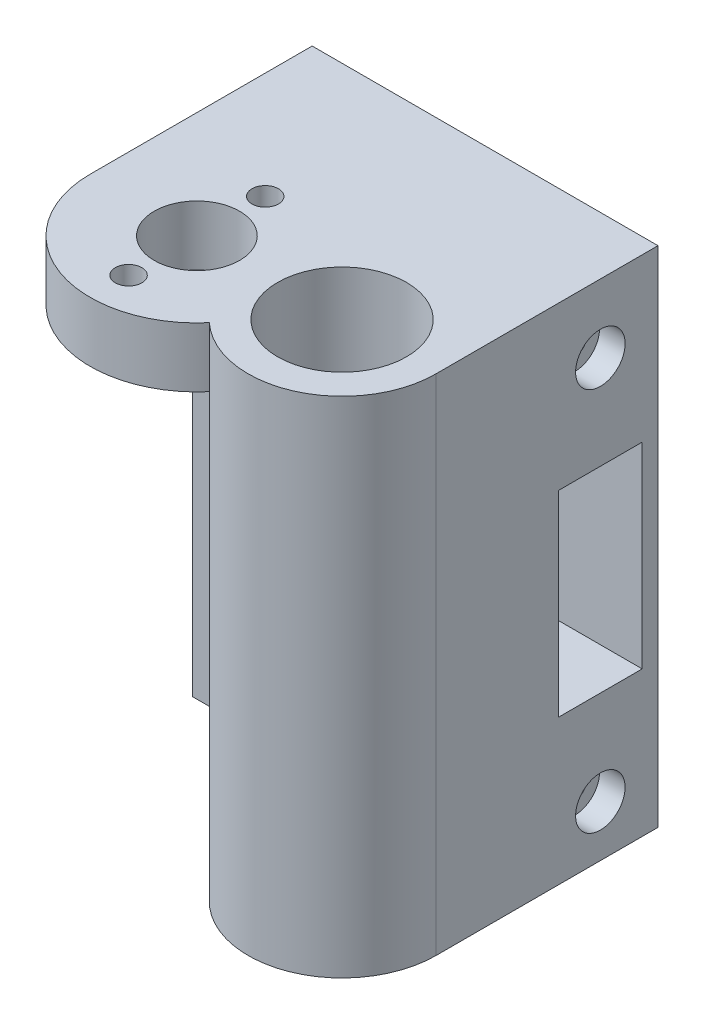
ISO-10303-21;
HEADER;
FILE_DESCRIPTION(('STEP AP214'),'2;1');
FILE_NAME('part.step','',(''),(''),'','','');
FILE_SCHEMA(('AUTOMOTIVE_DESIGN { 1 0 10303 214 1 1 1 1 }'));
ENDSEC;
DATA;
#1=APPLICATION_CONTEXT('core data for automotive mechanical design processes');
#2=APPLICATION_PROTOCOL_DEFINITION('international standard','automotive_design',2000,#1);
#3=PRODUCT_CONTEXT('',#1,'mechanical');
#4=PRODUCT('Part','Part','',(#3));
#5=PRODUCT_RELATED_PRODUCT_CATEGORY('part','',(#4));
#6=PRODUCT_DEFINITION_FORMATION('','',#4);
#7=PRODUCT_DEFINITION_CONTEXT('part definition',#1,'design');
#8=PRODUCT_DEFINITION('design','',#6,#7);
#9=PRODUCT_DEFINITION_SHAPE('','',#8);
#10=(LENGTH_UNIT() NAMED_UNIT(*) SI_UNIT(.MILLI.,.METRE.));
#11=(NAMED_UNIT(*) PLANE_ANGLE_UNIT() SI_UNIT($,.RADIAN.));
#12=(NAMED_UNIT(*) SI_UNIT($,.STERADIAN.) SOLID_ANGLE_UNIT());
#13=UNCERTAINTY_MEASURE_WITH_UNIT(LENGTH_MEASURE(1.E-05),#10,'distance_accuracy_value','');
#14=(GEOMETRIC_REPRESENTATION_CONTEXT(3) GLOBAL_UNCERTAINTY_ASSIGNED_CONTEXT((#13)) GLOBAL_UNIT_ASSIGNED_CONTEXT((#10,
#11,#12)) REPRESENTATION_CONTEXT('',''));
#15=CARTESIAN_POINT('',(0.,0.,0.));
#16=DIRECTION('',(0.,0.,1.));
#17=DIRECTION('',(1.,0.,0.));
#18=AXIS2_PLACEMENT_3D('',#15,#16,#17);
#19=CARTESIAN_POINT('',(-12.5,-46.,-19.25));
#20=DIRECTION('',(1.,0.,0.));
#21=DIRECTION('',(0.,0.,-1.));
#22=AXIS2_PLACEMENT_3D('',#19,#20,#21);
#23=CYLINDRICAL_SURFACE('',#22,1.4);
#24=CARTESIAN_POINT('',(22.5,-46.,-19.25));
#25=DIRECTION('',(-1.,0.,0.));
#26=DIRECTION('',(0.,0.,1.));
#27=AXIS2_PLACEMENT_3D('',#24,#25,#26);
#28=CIRCLE('',#27,1.4);
#29=CARTESIAN_POINT('',(22.5,-46.,-17.85));
#30=VERTEX_POINT('',#29);
#31=EDGE_CURVE('E251',#30,#30,#28,.T.);
#32=ORIENTED_EDGE('',*,*,#31,.T.);
#33=EDGE_LOOP('',(#32));
#34=FACE_BOUND('',#33,.T.);
#35=CARTESIAN_POINT('',(25.,-46.,-19.25));
#36=DIRECTION('',(1.,0.,0.));
#37=DIRECTION('',(0.,0.,-1.));
#38=AXIS2_PLACEMENT_3D('',#35,#36,#37);
#39=CIRCLE('',#38,1.4);
#40=CARTESIAN_POINT('',(25.,-46.,-20.65));
#41=VERTEX_POINT('',#40);
#42=EDGE_CURVE('E268',#41,#41,#39,.T.);
#43=ORIENTED_EDGE('',*,*,#42,.T.);
#44=EDGE_LOOP('',(#43));
#45=FACE_BOUND('',#44,.T.);
#46=ADVANCED_FACE('F37',(#34,#45),#23,.F.);
#47=CARTESIAN_POINT('',(-12.5,-1.,-19.25));
#48=DIRECTION('',(1.,0.,0.));
#49=DIRECTION('',(0.,0.,-1.));
#50=AXIS2_PLACEMENT_3D('',#47,#48,#49);
#51=CYLINDRICAL_SURFACE('',#50,1.4);
#52=CARTESIAN_POINT('',(22.5,-1.,-19.25));
#53=DIRECTION('',(-1.,0.,0.));
#54=DIRECTION('',(0.,0.,1.));
#55=AXIS2_PLACEMENT_3D('',#52,#53,#54);
#56=CIRCLE('',#55,1.4);
#57=CARTESIAN_POINT('',(22.5,-1.,-17.85));
#58=VERTEX_POINT('',#57);
#59=EDGE_CURVE('E159',#58,#58,#56,.T.);
#60=ORIENTED_EDGE('',*,*,#59,.T.);
#61=EDGE_LOOP('',(#60));
#62=FACE_BOUND('',#61,.T.);
#63=CARTESIAN_POINT('',(25.,-1.,-19.25));
#64=DIRECTION('',(1.,0.,0.));
#65=DIRECTION('',(0.,0.,-1.));
#66=AXIS2_PLACEMENT_3D('',#63,#64,#65);
#67=CIRCLE('',#66,1.4);
#68=CARTESIAN_POINT('',(25.,-1.,-20.65));
#69=VERTEX_POINT('',#68);
#70=EDGE_CURVE('E260',#69,#69,#67,.T.);
#71=ORIENTED_EDGE('',*,*,#70,.T.);
#72=EDGE_LOOP('',(#71));
#73=FACE_BOUND('',#72,.T.);
#74=ADVANCED_FACE('F364',(#62,#73),#51,.F.);
#75=CARTESIAN_POINT('',(17.,0.,0.));
#76=DIRECTION('',(0.,1.,0.));
#77=DIRECTION('',(0.,0.,1.));
#78=AXIS2_PLACEMENT_3D('',#75,#76,#77);
#79=PLANE('',#78);
#80=CARTESIAN_POINT('',(0.,0.,8.));
#81=DIRECTION('',(0.,1.,0.));
#82=DIRECTION('',(0.,0.,1.));
#83=AXIS2_PLACEMENT_3D('',#80,#81,#82);
#84=CIRCLE('',#83,1.55);
#85=CARTESIAN_POINT('',(0.,0.,9.55));
#86=VERTEX_POINT('',#85);
#87=EDGE_CURVE('E288',#86,#86,#84,.T.);
#88=ORIENTED_EDGE('',*,*,#87,.T.);
#89=EDGE_LOOP('',(#88));
#90=FACE_BOUND('',#89,.T.);
#91=CARTESIAN_POINT('',(0.,0.,-8.));
#92=DIRECTION('',(0.,1.,0.));
#93=DIRECTION('',(0.,0.,1.));
#94=AXIS2_PLACEMENT_3D('',#91,#92,#93);
#95=CIRCLE('',#94,1.55);
#96=CARTESIAN_POINT('',(0.,0.,-6.45));
#97=VERTEX_POINT('',#96);
#98=EDGE_CURVE('E280',#97,#97,#95,.T.);
#99=ORIENTED_EDGE('',*,*,#98,.T.);
#100=EDGE_LOOP('',(#99));
#101=FACE_BOUND('',#100,.T.);
#102=CARTESIAN_POINT('',(0.,0.,0.));
#103=DIRECTION('',(0.,1.,0.));
#104=DIRECTION('',(0.,0.,1.));
#105=AXIS2_PLACEMENT_3D('',#102,#103,#104);
#106=CIRCLE('',#105,5.);
#107=CARTESIAN_POINT('',(0.,0.,5.));
#108=VERTEX_POINT('',#107);
#109=EDGE_CURVE('E217',#108,#108,#106,.T.);
#110=ORIENTED_EDGE('',*,*,#109,.T.);
#111=EDGE_LOOP('',(#110));
#112=FACE_BOUND('',#111,.T.);
#113=CARTESIAN_POINT('',(17.,0.,0.));
#114=DIRECTION('',(0.,-1.,0.));
#115=DIRECTION('',(0.,0.,-1.));
#116=AXIS2_PLACEMENT_3D('',#113,#114,#115);
#117=CIRCLE('',#116,11.);
#118=CARTESIAN_POINT('',(9.53676470588235,0.,8.08084890000034));
#119=VERTEX_POINT('',#118);
#120=CARTESIAN_POINT('',(5.99999999999999,0.,0.));
#121=VERTEX_POINT('',#120);
#122=EDGE_CURVE('E11',#119,#121,#117,.T.);
#123=ORIENTED_EDGE('',*,*,#122,.F.);
#124=CARTESIAN_POINT('',(0.,0.,0.));
#125=DIRECTION('',(0.,1.,0.));
#126=DIRECTION('',(0.,0.,1.));
#127=AXIS2_PLACEMENT_3D('',#124,#125,#126);
#128=CIRCLE('',#127,12.5);
#129=CARTESIAN_POINT('',(-12.5,0.,0.));
#130=VERTEX_POINT('',#129);
#131=EDGE_CURVE('E228',#130,#119,#128,.T.);
#132=ORIENTED_EDGE('',*,*,#131,.F.);
#133=DIRECTION('',(0.,0.,1.));
#134=VECTOR('',#133,1.);
#135=CARTESIAN_POINT('',(-12.5,0.,0.));
#136=LINE('',#135,#134);
#137=CARTESIAN_POINT('',(-12.5,0.,-12.));
#138=VERTEX_POINT('',#137);
#139=EDGE_CURVE('E221',#138,#130,#136,.T.);
#140=ORIENTED_EDGE('',*,*,#139,.F.);
#141=DIRECTION('',(1.,0.,0.));
#142=VECTOR('',#141,1.);
#143=CARTESIAN_POINT('',(0.,0.,-12.));
#144=LINE('',#143,#142);
#145=CARTESIAN_POINT('',(6.,0.,-12.));
#146=VERTEX_POINT('',#145);
#147=EDGE_CURVE('E185',#138,#146,#144,.T.);
#148=ORIENTED_EDGE('',*,*,#147,.T.);
#149=DIRECTION('',(0.,0.,-1.));
#150=VECTOR('',#149,1.);
#151=CARTESIAN_POINT('',(5.99999999999999,0.,0.));
#152=LINE('',#151,#150);
#153=EDGE_CURVE('E178',#121,#146,#152,.T.);
#154=ORIENTED_EDGE('',*,*,#153,.F.);
#155=EDGE_LOOP('',(#123,#132,#140,#148,#154));
#156=FACE_BOUND('',#155,.T.);
#157=ADVANCED_FACE('F301',(#90,#101,#112,#156),#79,.F.);
#158=CARTESIAN_POINT('',(17.,7.,0.));
#159=DIRECTION('',(0.,1.,0.));
#160=DIRECTION('',(0.,0.,1.));
#161=AXIS2_PLACEMENT_3D('',#158,#159,#160);
#162=PLANE('',#161);
#163=CARTESIAN_POINT('',(0.,7.,8.));
#164=DIRECTION('',(0.,1.,0.));
#165=DIRECTION('',(0.,0.,1.));
#166=AXIS2_PLACEMENT_3D('',#163,#164,#165);
#167=CIRCLE('',#166,1.55);
#168=CARTESIAN_POINT('',(0.,7.,9.55));
#169=VERTEX_POINT('',#168);
#170=EDGE_CURVE('E291',#169,#169,#167,.T.);
#171=ORIENTED_EDGE('',*,*,#170,.F.);
#172=EDGE_LOOP('',(#171));
#173=FACE_BOUND('',#172,.T.);
#174=CARTESIAN_POINT('',(0.,7.,-8.));
#175=DIRECTION('',(0.,1.,0.));
#176=DIRECTION('',(0.,0.,1.));
#177=AXIS2_PLACEMENT_3D('',#174,#175,#176);
#178=CIRCLE('',#177,1.55);
#179=CARTESIAN_POINT('',(0.,7.,-6.45));
#180=VERTEX_POINT('',#179);
#181=EDGE_CURVE('E285',#180,#180,#178,.T.);
#182=ORIENTED_EDGE('',*,*,#181,.F.);
#183=EDGE_LOOP('',(#182));
#184=FACE_BOUND('',#183,.T.);
#185=CARTESIAN_POINT('',(0.,7.,0.));
#186=DIRECTION('',(0.,1.,0.));
#187=DIRECTION('',(0.,0.,1.));
#188=AXIS2_PLACEMENT_3D('',#185,#186,#187);
#189=CIRCLE('',#188,5.);
#190=CARTESIAN_POINT('',(0.,7.,5.));
#191=VERTEX_POINT('',#190);
#192=EDGE_CURVE('E218',#191,#191,#189,.T.);
#193=ORIENTED_EDGE('',*,*,#192,.F.);
#194=EDGE_LOOP('',(#193));
#195=FACE_BOUND('',#194,.T.);
#196=CARTESIAN_POINT('',(17.,7.,0.));
#197=DIRECTION('',(0.,1.,0.));
#198=DIRECTION('',(0.,0.,1.));
#199=AXIS2_PLACEMENT_3D('',#196,#197,#198);
#200=CIRCLE('',#199,11.);
#201=CARTESIAN_POINT('',(9.53676470588235,7.,8.08084890000034));
#202=VERTEX_POINT('',#201);
#203=CARTESIAN_POINT('',(28.,7.,0.));
#204=VERTEX_POINT('',#203);
#205=EDGE_CURVE('E224',#202,#204,#200,.T.);
#206=ORIENTED_EDGE('',*,*,#205,.T.);
#207=DIRECTION('',(0.,0.,-1.));
#208=VECTOR('',#207,1.);
#209=CARTESIAN_POINT('',(28.,7.,0.));
#210=LINE('',#209,#208);
#211=CARTESIAN_POINT('',(28.,7.,-26.));
#212=VERTEX_POINT('',#211);
#213=EDGE_CURVE('E227',#204,#212,#210,.T.);
#214=ORIENTED_EDGE('',*,*,#213,.T.);
#215=DIRECTION('',(-1.,0.,0.));
#216=VECTOR('',#215,1.);
#217=CARTESIAN_POINT('',(-12.5,7.,-26.));
#218=LINE('',#217,#216);
#219=CARTESIAN_POINT('',(-12.5,7.,-26.));
#220=VERTEX_POINT('',#219);
#221=EDGE_CURVE('E230',#212,#220,#218,.T.);
#222=ORIENTED_EDGE('',*,*,#221,.T.);
#223=DIRECTION('',(0.,0.,1.));
#224=VECTOR('',#223,1.);
#225=CARTESIAN_POINT('',(-12.5,7.,0.));
#226=LINE('',#225,#224);
#227=CARTESIAN_POINT('',(-12.5,7.,0.));
#228=VERTEX_POINT('',#227);
#229=EDGE_CURVE('E232',#220,#228,#226,.T.);
#230=ORIENTED_EDGE('',*,*,#229,.T.);
#231=CARTESIAN_POINT('',(0.,7.,0.));
#232=DIRECTION('',(0.,1.,0.));
#233=DIRECTION('',(0.,0.,1.));
#234=AXIS2_PLACEMENT_3D('',#231,#232,#233);
#235=CIRCLE('',#234,12.5);
#236=EDGE_CURVE('E234',#228,#202,#235,.T.);
#237=ORIENTED_EDGE('',*,*,#236,.T.);
#238=EDGE_LOOP('',(#206,#214,#222,#230,#237));
#239=FACE_BOUND('',#238,.T.);
#240=CARTESIAN_POINT('',(17.,7.,0.));
#241=DIRECTION('',(0.,1.,0.));
#242=DIRECTION('',(0.,0.,1.));
#243=AXIS2_PLACEMENT_3D('',#240,#241,#242);
#244=CIRCLE('',#243,7.55);
#245=CARTESIAN_POINT('',(17.,7.,7.55));
#246=VERTEX_POINT('',#245);
#247=EDGE_CURVE('E214',#246,#246,#244,.T.);
#248=ORIENTED_EDGE('',*,*,#247,.F.);
#249=EDGE_LOOP('',(#248));
#250=FACE_BOUND('',#249,.T.);
#251=ADVANCED_FACE('F298',(#173,#184,#195,#239,#250),#162,.T.);
#252=CARTESIAN_POINT('',(17.,7.,0.));
#253=DIRECTION('',(0.,-1.,0.));
#254=DIRECTION('',(0.,0.,-1.));
#255=AXIS2_PLACEMENT_3D('',#252,#253,#254);
#256=CYLINDRICAL_SURFACE('',#255,11.);
#257=DIRECTION('',(0.,-1.,0.));
#258=VECTOR('',#257,1.);
#259=CARTESIAN_POINT('',(9.53676470588235,7.,8.08084890000034));
#260=LINE('',#259,#258);
#261=EDGE_CURVE('E236',#202,#119,#260,.T.);
#262=ORIENTED_EDGE('',*,*,#261,.T.);
#263=ORIENTED_EDGE('',*,*,#122,.T.);
#264=DIRECTION('',(0.,1.,0.));
#265=VECTOR('',#264,1.);
#266=CARTESIAN_POINT('',(5.99999999999999,-52.,0.));
#267=LINE('',#266,#265);
#268=CARTESIAN_POINT('',(5.99999999999999,-52.,0.));
#269=VERTEX_POINT('',#268);
#270=EDGE_CURVE('E211',#269,#121,#267,.T.);
#271=ORIENTED_EDGE('',*,*,#270,.F.);
#272=CARTESIAN_POINT('',(17.,-52.,0.));
#273=DIRECTION('',(0.,-1.,0.));
#274=DIRECTION('',(0.,0.,-1.));
#275=AXIS2_PLACEMENT_3D('',#272,#273,#274);
#276=CIRCLE('',#275,11.);
#277=CARTESIAN_POINT('',(28.,-52.,0.));
#278=VERTEX_POINT('',#277);
#279=EDGE_CURVE('E184',#278,#269,#276,.T.);
#280=ORIENTED_EDGE('',*,*,#279,.F.);
#281=DIRECTION('',(0.,-1.,0.));
#282=VECTOR('',#281,1.);
#283=CARTESIAN_POINT('',(28.,7.,0.));
#284=LINE('',#283,#282);
#285=EDGE_CURVE('E46',#204,#278,#284,.T.);
#286=ORIENTED_EDGE('',*,*,#285,.F.);
#287=ORIENTED_EDGE('',*,*,#205,.F.);
#288=EDGE_LOOP('',(#262,#263,#271,#280,#286,#287));
#289=FACE_BOUND('',#288,.T.);
#290=ADVANCED_FACE('F39',(#289),#256,.T.);
#291=CARTESIAN_POINT('',(28.,7.,0.));
#292=DIRECTION('',(-1.,0.,0.));
#293=DIRECTION('',(0.,0.,1.));
#294=AXIS2_PLACEMENT_3D('',#291,#292,#293);
#295=PLANE('',#294);
#296=CARTESIAN_POINT('',(28.,-46.,-19.25));
#297=DIRECTION('',(1.,0.,0.));
#298=DIRECTION('',(0.,0.,-1.));
#299=AXIS2_PLACEMENT_3D('',#296,#297,#298);
#300=CIRCLE('',#299,2.9);
#301=CARTESIAN_POINT('',(28.,-46.,-22.15));
#302=VERTEX_POINT('',#301);
#303=EDGE_CURVE('E265',#302,#302,#300,.T.);
#304=ORIENTED_EDGE('',*,*,#303,.F.);
#305=EDGE_LOOP('',(#304));
#306=FACE_BOUND('',#305,.T.);
#307=CARTESIAN_POINT('',(28.,-1.,-19.25));
#308=DIRECTION('',(1.,0.,0.));
#309=DIRECTION('',(0.,0.,-1.));
#310=AXIS2_PLACEMENT_3D('',#307,#308,#309);
#311=CIRCLE('',#310,2.9);
#312=CARTESIAN_POINT('',(28.,-1.,-22.15));
#313=VERTEX_POINT('',#312);
#314=EDGE_CURVE('E152',#313,#313,#311,.T.);
#315=ORIENTED_EDGE('',*,*,#314,.F.);
#316=EDGE_LOOP('',(#315));
#317=FACE_BOUND('',#316,.T.);
#318=DIRECTION('',(0.,0.,1.));
#319=VECTOR('',#318,1.);
#320=CARTESIAN_POINT('',(28.,-35.,-24.15));
#321=LINE('',#320,#319);
#322=CARTESIAN_POINT('',(28.,-35.,-24.15));
#323=VERTEX_POINT('',#322);
#324=CARTESIAN_POINT('',(28.,-35.,-14.35));
#325=VERTEX_POINT('',#324);
#326=EDGE_CURVE('E136',#323,#325,#321,.T.);
#327=ORIENTED_EDGE('',*,*,#326,.T.);
#328=DIRECTION('',(0.,1.,0.));
#329=VECTOR('',#328,1.);
#330=CARTESIAN_POINT('',(28.,-35.,-14.35));
#331=LINE('',#330,#329);
#332=CARTESIAN_POINT('',(28.,-12.,-14.35));
#333=VERTEX_POINT('',#332);
#334=EDGE_CURVE('E130',#325,#333,#331,.T.);
#335=ORIENTED_EDGE('',*,*,#334,.T.);
#336=DIRECTION('',(0.,0.,-1.));
#337=VECTOR('',#336,1.);
#338=CARTESIAN_POINT('',(28.,-12.,-24.15));
#339=LINE('',#338,#337);
#340=CARTESIAN_POINT('',(28.,-12.,-24.15));
#341=VERTEX_POINT('',#340);
#342=EDGE_CURVE('E139',#333,#341,#339,.T.);
#343=ORIENTED_EDGE('',*,*,#342,.T.);
#344=DIRECTION('',(0.,-1.,0.));
#345=VECTOR('',#344,1.);
#346=CARTESIAN_POINT('',(28.,-35.,-24.15));
#347=LINE('',#346,#345);
#348=EDGE_CURVE('E54',#341,#323,#347,.T.);
#349=ORIENTED_EDGE('',*,*,#348,.T.);
#350=EDGE_LOOP('',(#327,#335,#343,#349));
#351=FACE_BOUND('',#350,.T.);
#352=ORIENTED_EDGE('',*,*,#285,.T.);
#353=DIRECTION('',(0.,0.,1.));
#354=VECTOR('',#353,1.);
#355=CARTESIAN_POINT('',(28.,-52.,0.));
#356=LINE('',#355,#354);
#357=CARTESIAN_POINT('',(28.,-52.,-26.));
#358=VERTEX_POINT('',#357);
#359=EDGE_CURVE('E199',#358,#278,#356,.T.);
#360=ORIENTED_EDGE('',*,*,#359,.F.);
#361=DIRECTION('',(0.,-1.,0.));
#362=VECTOR('',#361,1.);
#363=CARTESIAN_POINT('',(28.,7.,-26.));
#364=LINE('',#363,#362);
#365=EDGE_CURVE('E247',#212,#358,#364,.T.);
#366=ORIENTED_EDGE('',*,*,#365,.F.);
#367=ORIENTED_EDGE('',*,*,#213,.F.);
#368=EDGE_LOOP('',(#352,#360,#366,#367));
#369=FACE_BOUND('',#368,.T.);
#370=ADVANCED_FACE('F143',(#306,#317,#351,#369),#295,.F.);
#371=CARTESIAN_POINT('',(-12.5,7.,-26.));
#372=DIRECTION('',(0.,0.,1.));
#373=DIRECTION('',(1.,0.,0.));
#374=AXIS2_PLACEMENT_3D('',#371,#372,#373);
#375=PLANE('',#374);
#376=CARTESIAN_POINT('',(-5.5,-23.5,-26.));
#377=DIRECTION('',(0.,0.,1.));
#378=DIRECTION('',(1.,0.,0.));
#379=AXIS2_PLACEMENT_3D('',#376,#377,#378);
#380=CIRCLE('',#379,1.5);
#381=CARTESIAN_POINT('',(-4.,-23.5,-26.));
#382=VERTEX_POINT('',#381);
#383=EDGE_CURVE('E279',#382,#382,#380,.T.);
#384=ORIENTED_EDGE('',*,*,#383,.T.);
#385=EDGE_LOOP('',(#384));
#386=FACE_BOUND('',#385,.T.);
#387=ORIENTED_EDGE('',*,*,#365,.T.);
#388=DIRECTION('',(1.,0.,0.));
#389=VECTOR('',#388,1.);
#390=CARTESIAN_POINT('',(0.,-52.,-26.));
#391=LINE('',#390,#389);
#392=CARTESIAN_POINT('',(-12.5,-52.,-26.));
#393=VERTEX_POINT('',#392);
#394=EDGE_CURVE('E196',#393,#358,#391,.T.);
#395=ORIENTED_EDGE('',*,*,#394,.F.);
#396=DIRECTION('',(0.,-1.,0.));
#397=VECTOR('',#396,1.);
#398=CARTESIAN_POINT('',(-12.5,7.,-26.));
#399=LINE('',#398,#397);
#400=EDGE_CURVE('E245',#220,#393,#399,.T.);
#401=ORIENTED_EDGE('',*,*,#400,.F.);
#402=ORIENTED_EDGE('',*,*,#221,.F.);
#403=EDGE_LOOP('',(#387,#395,#401,#402));
#404=FACE_BOUND('',#403,.T.);
#405=ADVANCED_FACE('F340',(#386,#404),#375,.F.);
#406=CARTESIAN_POINT('',(-12.5,7.,0.));
#407=DIRECTION('',(1.,0.,0.));
#408=DIRECTION('',(0.,0.,-1.));
#409=AXIS2_PLACEMENT_3D('',#406,#407,#408);
#410=PLANE('',#409);
#411=DIRECTION('',(0.,0.,-1.));
#412=VECTOR('',#411,1.);
#413=CARTESIAN_POINT('',(-12.5,-12.,-24.15));
#414=LINE('',#413,#412);
#415=CARTESIAN_POINT('',(-12.5,-12.,-14.35));
#416=VERTEX_POINT('',#415);
#417=CARTESIAN_POINT('',(-12.5,-12.,-24.15));
#418=VERTEX_POINT('',#417);
#419=EDGE_CURVE('E158',#416,#418,#414,.T.);
#420=ORIENTED_EDGE('',*,*,#419,.F.);
#421=DIRECTION('',(0.,1.,0.));
#422=VECTOR('',#421,1.);
#423=CARTESIAN_POINT('',(-12.5,-35.,-14.35));
#424=LINE('',#423,#422);
#425=CARTESIAN_POINT('',(-12.5,-35.,-14.35));
#426=VERTEX_POINT('',#425);
#427=EDGE_CURVE('E62',#426,#416,#424,.T.);
#428=ORIENTED_EDGE('',*,*,#427,.F.);
#429=DIRECTION('',(0.,0.,1.));
#430=VECTOR('',#429,1.);
#431=CARTESIAN_POINT('',(-12.5,-35.,-24.15));
#432=LINE('',#431,#430);
#433=CARTESIAN_POINT('',(-12.5,-35.,-24.15));
#434=VERTEX_POINT('',#433);
#435=EDGE_CURVE('E146',#434,#426,#432,.T.);
#436=ORIENTED_EDGE('',*,*,#435,.F.);
#437=DIRECTION('',(0.,-1.,0.));
#438=VECTOR('',#437,1.);
#439=CARTESIAN_POINT('',(-12.5,-35.,-24.15));
#440=LINE('',#439,#438);
#441=EDGE_CURVE('E149',#418,#434,#440,.T.);
#442=ORIENTED_EDGE('',*,*,#441,.F.);
#443=EDGE_LOOP('',(#420,#428,#436,#442));
#444=FACE_BOUND('',#443,.T.);
#445=CARTESIAN_POINT('',(-12.5,-46.,-19.25));
#446=DIRECTION('',(-1.,0.,0.));
#447=DIRECTION('',(0.,0.,1.));
#448=AXIS2_PLACEMENT_3D('',#445,#446,#447);
#449=CIRCLE('',#448,4.1);
#450=CARTESIAN_POINT('',(-12.5,-46.,-15.15));
#451=VERTEX_POINT('',#450);
#452=EDGE_CURVE('E165',#451,#451,#449,.T.);
#453=ORIENTED_EDGE('',*,*,#452,.F.);
#454=EDGE_LOOP('',(#453));
#455=FACE_BOUND('',#454,.T.);
#456=CARTESIAN_POINT('',(-12.5,-1.,-19.25));
#457=DIRECTION('',(-1.,0.,0.));
#458=DIRECTION('',(0.,0.,1.));
#459=AXIS2_PLACEMENT_3D('',#456,#457,#458);
#460=CIRCLE('',#459,4.1);
#461=CARTESIAN_POINT('',(-12.5,-1.,-15.15));
#462=VERTEX_POINT('',#461);
#463=EDGE_CURVE('E172',#462,#462,#460,.T.);
#464=ORIENTED_EDGE('',*,*,#463,.F.);
#465=EDGE_LOOP('',(#464));
#466=FACE_BOUND('',#465,.T.);
#467=ORIENTED_EDGE('',*,*,#400,.T.);
#468=DIRECTION('',(0.,0.,-1.));
#469=VECTOR('',#468,1.);
#470=CARTESIAN_POINT('',(-12.5,-52.,0.));
#471=LINE('',#470,#469);
#472=CARTESIAN_POINT('',(-12.5,-52.,-12.));
#473=VERTEX_POINT('',#472);
#474=EDGE_CURVE('E193',#473,#393,#471,.T.);
#475=ORIENTED_EDGE('',*,*,#474,.F.);
#476=DIRECTION('',(0.,1.,0.));
#477=VECTOR('',#476,1.);
#478=CARTESIAN_POINT('',(-12.5,-52.,-12.));
#479=LINE('',#478,#477);
#480=EDGE_CURVE('E201',#473,#138,#479,.T.);
#481=ORIENTED_EDGE('',*,*,#480,.T.);
#482=ORIENTED_EDGE('',*,*,#139,.T.);
#483=DIRECTION('',(0.,-1.,0.));
#484=VECTOR('',#483,1.);
#485=CARTESIAN_POINT('',(-12.5,7.,0.));
#486=LINE('',#485,#484);
#487=EDGE_CURVE('E242',#228,#130,#486,.T.);
#488=ORIENTED_EDGE('',*,*,#487,.F.);
#489=ORIENTED_EDGE('',*,*,#229,.F.);
#490=EDGE_LOOP('',(#467,#475,#481,#482,#488,#489));
#491=FACE_BOUND('',#490,.T.);
#492=ADVANCED_FACE('F351',(#444,#455,#466,#491),#410,.F.);
#493=CARTESIAN_POINT('',(0.,7.,0.));
#494=DIRECTION('',(0.,-1.,0.));
#495=DIRECTION('',(0.,0.,-1.));
#496=AXIS2_PLACEMENT_3D('',#493,#494,#495);
#497=CYLINDRICAL_SURFACE('',#496,12.5);
#498=ORIENTED_EDGE('',*,*,#131,.T.);
#499=ORIENTED_EDGE('',*,*,#261,.F.);
#500=ORIENTED_EDGE('',*,*,#236,.F.);
#501=ORIENTED_EDGE('',*,*,#487,.T.);
#502=EDGE_LOOP('',(#498,#499,#500,#501));
#503=FACE_BOUND('',#502,.T.);
#504=ADVANCED_FACE('F347',(#503),#497,.T.);
#505=CARTESIAN_POINT('',(0.,7.,0.));
#506=DIRECTION('',(0.,-1.,0.));
#507=DIRECTION('',(0.,0.,-1.));
#508=AXIS2_PLACEMENT_3D('',#505,#506,#507);
#509=CYLINDRICAL_SURFACE('',#508,5.);
#510=ORIENTED_EDGE('',*,*,#192,.T.);
#511=EDGE_LOOP('',(#510));
#512=FACE_BOUND('',#511,.T.);
#513=ORIENTED_EDGE('',*,*,#109,.F.);
#514=EDGE_LOOP('',(#513));
#515=FACE_BOUND('',#514,.T.);
#516=ADVANCED_FACE('F316',(#512,#515),#509,.F.);
#517=CARTESIAN_POINT('',(17.,7.,0.));
#518=DIRECTION('',(0.,-1.,0.));
#519=DIRECTION('',(0.,0.,-1.));
#520=AXIS2_PLACEMENT_3D('',#517,#518,#519);
#521=CYLINDRICAL_SURFACE('',#520,7.55);
#522=ORIENTED_EDGE('',*,*,#247,.T.);
#523=EDGE_LOOP('',(#522));
#524=FACE_BOUND('',#523,.T.);
#525=CARTESIAN_POINT('',(17.,-52.,0.));
#526=DIRECTION('',(0.,-1.,0.));
#527=DIRECTION('',(0.,0.,-1.));
#528=AXIS2_PLACEMENT_3D('',#525,#526,#527);
#529=CIRCLE('',#528,7.55);
#530=CARTESIAN_POINT('',(17.,-52.,-7.55));
#531=VERTEX_POINT('',#530);
#532=EDGE_CURVE('E181',#531,#531,#529,.F.);
#533=ORIENTED_EDGE('',*,*,#532,.F.);
#534=EDGE_LOOP('',(#533));
#535=FACE_BOUND('',#534,.T.);
#536=ADVANCED_FACE('F312',(#524,#535),#521,.F.);
#537=CARTESIAN_POINT('',(5.99999999999999,-52.,0.));
#538=DIRECTION('',(1.,0.,0.));
#539=DIRECTION('',(0.,0.,-1.));
#540=AXIS2_PLACEMENT_3D('',#537,#538,#539);
#541=PLANE('',#540);
#542=ORIENTED_EDGE('',*,*,#153,.T.);
#543=DIRECTION('',(0.,1.,0.));
#544=VECTOR('',#543,1.);
#545=CARTESIAN_POINT('',(6.,-52.,-12.));
#546=LINE('',#545,#544);
#547=CARTESIAN_POINT('',(6.,-52.,-12.));
#548=VERTEX_POINT('',#547);
#549=EDGE_CURVE('E208',#548,#146,#546,.T.);
#550=ORIENTED_EDGE('',*,*,#549,.F.);
#551=DIRECTION('',(0.,0.,-1.));
#552=VECTOR('',#551,1.);
#553=CARTESIAN_POINT('',(5.99999999999999,-52.,0.));
#554=LINE('',#553,#552);
#555=EDGE_CURVE('E188',#269,#548,#554,.T.);
#556=ORIENTED_EDGE('',*,*,#555,.F.);
#557=ORIENTED_EDGE('',*,*,#270,.T.);
#558=EDGE_LOOP('',(#542,#550,#556,#557));
#559=FACE_BOUND('',#558,.T.);
#560=ADVANCED_FACE('F315',(#559),#541,.F.);
#561=CARTESIAN_POINT('',(0.,-52.,-12.));
#562=DIRECTION('',(0.,0.,1.));
#563=DIRECTION('',(1.,0.,0.));
#564=AXIS2_PLACEMENT_3D('',#561,#562,#563);
#565=PLANE('',#564);
#566=CARTESIAN_POINT('',(-5.5,-23.5,-12.));
#567=DIRECTION('',(0.,0.,1.));
#568=DIRECTION('',(1.,0.,0.));
#569=AXIS2_PLACEMENT_3D('',#566,#567,#568);
#570=CIRCLE('',#569,1.5);
#571=CARTESIAN_POINT('',(-4.,-23.5,-12.));
#572=VERTEX_POINT('',#571);
#573=EDGE_CURVE('E276',#572,#572,#570,.T.);
#574=ORIENTED_EDGE('',*,*,#573,.F.);
#575=EDGE_LOOP('',(#574));
#576=FACE_BOUND('',#575,.T.);
#577=ORIENTED_EDGE('',*,*,#147,.F.);
#578=ORIENTED_EDGE('',*,*,#480,.F.);
#579=DIRECTION('',(1.,0.,0.));
#580=VECTOR('',#579,1.);
#581=CARTESIAN_POINT('',(0.,-52.,-12.));
#582=LINE('',#581,#580);
#583=EDGE_CURVE('E190',#473,#548,#582,.T.);
#584=ORIENTED_EDGE('',*,*,#583,.T.);
#585=ORIENTED_EDGE('',*,*,#549,.T.);
#586=EDGE_LOOP('',(#577,#578,#584,#585));
#587=FACE_BOUND('',#586,.T.);
#588=ADVANCED_FACE('F324',(#576,#587),#565,.T.);
#589=CARTESIAN_POINT('',(0.,-52.,0.));
#590=DIRECTION('',(0.,-1.,0.));
#591=DIRECTION('',(0.,0.,-1.));
#592=AXIS2_PLACEMENT_3D('',#589,#590,#591);
#593=PLANE('',#592);
#594=ORIENTED_EDGE('',*,*,#532,.T.);
#595=EDGE_LOOP('',(#594));
#596=FACE_BOUND('',#595,.T.);
#597=ORIENTED_EDGE('',*,*,#279,.T.);
#598=ORIENTED_EDGE('',*,*,#555,.T.);
#599=ORIENTED_EDGE('',*,*,#583,.F.);
#600=ORIENTED_EDGE('',*,*,#474,.T.);
#601=ORIENTED_EDGE('',*,*,#394,.T.);
#602=ORIENTED_EDGE('',*,*,#359,.T.);
#603=EDGE_LOOP('',(#597,#598,#599,#600,#601,#602));
#604=FACE_BOUND('',#603,.T.);
#605=ADVANCED_FACE('F320',(#596,#604),#593,.T.);
#606=CARTESIAN_POINT('',(22.5,-1.,-19.25));
#607=DIRECTION('',(-1.,0.,0.));
#608=DIRECTION('',(0.,0.,1.));
#609=AXIS2_PLACEMENT_3D('',#606,#607,#608);
#610=CYLINDRICAL_SURFACE('',#609,4.1);
#611=CARTESIAN_POINT('',(22.5,-1.,-19.25));
#612=DIRECTION('',(-1.,0.,0.));
#613=DIRECTION('',(0.,0.,1.));
#614=AXIS2_PLACEMENT_3D('',#611,#612,#613);
#615=CIRCLE('',#614,4.1);
#616=CARTESIAN_POINT('',(22.5,-1.,-15.15));
#617=VERTEX_POINT('',#616);
#618=EDGE_CURVE('E175',#617,#617,#615,.T.);
#619=ORIENTED_EDGE('',*,*,#618,.F.);
#620=EDGE_LOOP('',(#619));
#621=FACE_BOUND('',#620,.T.);
#622=ORIENTED_EDGE('',*,*,#463,.T.);
#623=EDGE_LOOP('',(#622));
#624=FACE_BOUND('',#623,.T.);
#625=ADVANCED_FACE('F323',(#621,#624),#610,.F.);
#626=CARTESIAN_POINT('',(22.5,-1.,-19.25));
#627=DIRECTION('',(-1.,0.,0.));
#628=DIRECTION('',(0.,0.,1.));
#629=AXIS2_PLACEMENT_3D('',#626,#627,#628);
#630=PLANE('',#629);
#631=ORIENTED_EDGE('',*,*,#59,.F.);
#632=EDGE_LOOP('',(#631));
#633=FACE_BOUND('',#632,.T.);
#634=ORIENTED_EDGE('',*,*,#618,.T.);
#635=EDGE_LOOP('',(#634));
#636=FACE_BOUND('',#635,.T.);
#637=ADVANCED_FACE('F396',(#633,#636),#630,.T.);
#638=CARTESIAN_POINT('',(22.5,-46.,-19.25));
#639=DIRECTION('',(-1.,0.,0.));
#640=DIRECTION('',(0.,0.,1.));
#641=AXIS2_PLACEMENT_3D('',#638,#639,#640);
#642=CYLINDRICAL_SURFACE('',#641,4.1);
#643=CARTESIAN_POINT('',(22.5,-46.,-19.25));
#644=DIRECTION('',(-1.,0.,0.));
#645=DIRECTION('',(0.,0.,1.));
#646=AXIS2_PLACEMENT_3D('',#643,#644,#645);
#647=CIRCLE('',#646,4.1);
#648=CARTESIAN_POINT('',(22.5,-46.,-15.15));
#649=VERTEX_POINT('',#648);
#650=EDGE_CURVE('E169',#649,#649,#647,.T.);
#651=ORIENTED_EDGE('',*,*,#650,.F.);
#652=EDGE_LOOP('',(#651));
#653=FACE_BOUND('',#652,.T.);
#654=ORIENTED_EDGE('',*,*,#452,.T.);
#655=EDGE_LOOP('',(#654));
#656=FACE_BOUND('',#655,.T.);
#657=ADVANCED_FACE('F392',(#653,#656),#642,.F.);
#658=CARTESIAN_POINT('',(22.5,-46.,-19.25));
#659=DIRECTION('',(-1.,0.,0.));
#660=DIRECTION('',(0.,0.,1.));
#661=AXIS2_PLACEMENT_3D('',#658,#659,#660);
#662=PLANE('',#661);
#663=ORIENTED_EDGE('',*,*,#31,.F.);
#664=EDGE_LOOP('',(#663));
#665=FACE_BOUND('',#664,.T.);
#666=ORIENTED_EDGE('',*,*,#650,.T.);
#667=EDGE_LOOP('',(#666));
#668=FACE_BOUND('',#667,.T.);
#669=ADVANCED_FACE('F388',(#665,#668),#662,.T.);
#670=CARTESIAN_POINT('',(28.,-35.,-14.35));
#671=DIRECTION('',(0.,0.,1.));
#672=DIRECTION('',(1.,0.,0.));
#673=AXIS2_PLACEMENT_3D('',#670,#671,#672);
#674=PLANE('',#673);
#675=CARTESIAN_POINT('',(-5.5,-23.5,-14.35));
#676=DIRECTION('',(0.,0.,1.));
#677=DIRECTION('',(1.,0.,0.));
#678=AXIS2_PLACEMENT_3D('',#675,#676,#677);
#679=CIRCLE('',#678,1.5);
#680=CARTESIAN_POINT('',(-4.,-23.5,-14.35));
#681=VERTEX_POINT('',#680);
#682=EDGE_CURVE('E273',#681,#681,#679,.T.);
#683=ORIENTED_EDGE('',*,*,#682,.T.);
#684=EDGE_LOOP('',(#683));
#685=FACE_BOUND('',#684,.T.);
#686=ORIENTED_EDGE('',*,*,#427,.T.);
#687=DIRECTION('',(-1.,0.,0.));
#688=VECTOR('',#687,1.);
#689=CARTESIAN_POINT('',(28.,-12.,-14.35));
#690=LINE('',#689,#688);
#691=EDGE_CURVE('E126',#333,#416,#690,.T.);
#692=ORIENTED_EDGE('',*,*,#691,.F.);
#693=ORIENTED_EDGE('',*,*,#334,.F.);
#694=DIRECTION('',(-1.,0.,0.));
#695=VECTOR('',#694,1.);
#696=CARTESIAN_POINT('',(28.,-35.,-14.35));
#697=LINE('',#696,#695);
#698=EDGE_CURVE('E163',#325,#426,#697,.T.);
#699=ORIENTED_EDGE('',*,*,#698,.T.);
#700=EDGE_LOOP('',(#686,#692,#693,#699));
#701=FACE_BOUND('',#700,.T.);
#702=ADVANCED_FACE('F128',(#685,#701),#674,.F.);
#703=CARTESIAN_POINT('',(28.,-35.,-24.15));
#704=DIRECTION('',(0.,-1.,0.));
#705=DIRECTION('',(0.,0.,-1.));
#706=AXIS2_PLACEMENT_3D('',#703,#704,#705);
#707=PLANE('',#706);
#708=ORIENTED_EDGE('',*,*,#435,.T.);
#709=ORIENTED_EDGE('',*,*,#698,.F.);
#710=ORIENTED_EDGE('',*,*,#326,.F.);
#711=DIRECTION('',(-1.,0.,0.));
#712=VECTOR('',#711,1.);
#713=CARTESIAN_POINT('',(28.,-35.,-24.15));
#714=LINE('',#713,#712);
#715=EDGE_CURVE('E166',#323,#434,#714,.T.);
#716=ORIENTED_EDGE('',*,*,#715,.T.);
#717=EDGE_LOOP('',(#708,#709,#710,#716));
#718=FACE_BOUND('',#717,.T.);
#719=ADVANCED_FACE('F376',(#718),#707,.F.);
#720=CARTESIAN_POINT('',(28.,-35.,-24.15));
#721=DIRECTION('',(0.,0.,-1.));
#722=DIRECTION('',(-1.,0.,0.));
#723=AXIS2_PLACEMENT_3D('',#720,#721,#722);
#724=PLANE('',#723);
#725=CARTESIAN_POINT('',(-5.5,-23.5,-24.15));
#726=DIRECTION('',(0.,0.,-1.));
#727=DIRECTION('',(-1.,0.,0.));
#728=AXIS2_PLACEMENT_3D('',#725,#726,#727);
#729=CIRCLE('',#728,1.5);
#730=CARTESIAN_POINT('',(-7.,-23.5,-24.15));
#731=VERTEX_POINT('',#730);
#732=EDGE_CURVE('E41',#731,#731,#729,.T.);
#733=ORIENTED_EDGE('',*,*,#732,.T.);
#734=EDGE_LOOP('',(#733));
#735=FACE_BOUND('',#734,.T.);
#736=ORIENTED_EDGE('',*,*,#441,.T.);
#737=ORIENTED_EDGE('',*,*,#715,.F.);
#738=ORIENTED_EDGE('',*,*,#348,.F.);
#739=DIRECTION('',(-1.,0.,0.));
#740=VECTOR('',#739,1.);
#741=CARTESIAN_POINT('',(28.,-12.,-24.15));
#742=LINE('',#741,#740);
#743=EDGE_CURVE('E135',#341,#418,#742,.T.);
#744=ORIENTED_EDGE('',*,*,#743,.T.);
#745=EDGE_LOOP('',(#736,#737,#738,#744));
#746=FACE_BOUND('',#745,.T.);
#747=ADVANCED_FACE('F379',(#735,#746),#724,.F.);
#748=CARTESIAN_POINT('',(28.,-12.,-24.15));
#749=DIRECTION('',(0.,1.,0.));
#750=DIRECTION('',(0.,0.,1.));
#751=AXIS2_PLACEMENT_3D('',#748,#749,#750);
#752=PLANE('',#751);
#753=ORIENTED_EDGE('',*,*,#419,.T.);
#754=ORIENTED_EDGE('',*,*,#743,.F.);
#755=ORIENTED_EDGE('',*,*,#342,.F.);
#756=ORIENTED_EDGE('',*,*,#691,.T.);
#757=EDGE_LOOP('',(#753,#754,#755,#756));
#758=FACE_BOUND('',#757,.T.);
#759=ADVANCED_FACE('F140',(#758),#752,.F.);
#760=CARTESIAN_POINT('',(25.,-1.,-19.25));
#761=DIRECTION('',(1.,0.,0.));
#762=DIRECTION('',(0.,0.,-1.));
#763=AXIS2_PLACEMENT_3D('',#760,#761,#762);
#764=CYLINDRICAL_SURFACE('',#763,2.9);
#765=CARTESIAN_POINT('',(25.,-1.,-19.25));
#766=DIRECTION('',(1.,0.,0.));
#767=DIRECTION('',(0.,0.,-1.));
#768=AXIS2_PLACEMENT_3D('',#765,#766,#767);
#769=CIRCLE('',#768,2.9);
#770=CARTESIAN_POINT('',(25.,-1.,-22.15));
#771=VERTEX_POINT('',#770);
#772=EDGE_CURVE('E253',#771,#771,#769,.T.);
#773=ORIENTED_EDGE('',*,*,#772,.F.);
#774=EDGE_LOOP('',(#773));
#775=FACE_BOUND('',#774,.T.);
#776=ORIENTED_EDGE('',*,*,#314,.T.);
#777=EDGE_LOOP('',(#776));
#778=FACE_BOUND('',#777,.T.);
#779=ADVANCED_FACE('F373',(#775,#778),#764,.F.);
#780=CARTESIAN_POINT('',(25.,-1.,-19.25));
#781=DIRECTION('',(1.,0.,0.));
#782=DIRECTION('',(0.,0.,-1.));
#783=AXIS2_PLACEMENT_3D('',#780,#781,#782);
#784=PLANE('',#783);
#785=ORIENTED_EDGE('',*,*,#70,.F.);
#786=EDGE_LOOP('',(#785));
#787=FACE_BOUND('',#786,.T.);
#788=ORIENTED_EDGE('',*,*,#772,.T.);
#789=EDGE_LOOP('',(#788));
#790=FACE_BOUND('',#789,.T.);
#791=ADVANCED_FACE('F443',(#787,#790),#784,.T.);
#792=CARTESIAN_POINT('',(25.,-46.,-19.25));
#793=DIRECTION('',(1.,0.,0.));
#794=DIRECTION('',(0.,0.,-1.));
#795=AXIS2_PLACEMENT_3D('',#792,#793,#794);
#796=CYLINDRICAL_SURFACE('',#795,2.9);
#797=CARTESIAN_POINT('',(25.,-46.,-19.25));
#798=DIRECTION('',(1.,0.,0.));
#799=DIRECTION('',(0.,0.,-1.));
#800=AXIS2_PLACEMENT_3D('',#797,#798,#799);
#801=CIRCLE('',#800,2.9);
#802=CARTESIAN_POINT('',(25.,-46.,-22.15));
#803=VERTEX_POINT('',#802);
#804=EDGE_CURVE('E264',#803,#803,#801,.T.);
#805=ORIENTED_EDGE('',*,*,#804,.F.);
#806=EDGE_LOOP('',(#805));
#807=FACE_BOUND('',#806,.T.);
#808=ORIENTED_EDGE('',*,*,#303,.T.);
#809=EDGE_LOOP('',(#808));
#810=FACE_BOUND('',#809,.T.);
#811=ADVANCED_FACE('F440',(#807,#810),#796,.F.);
#812=CARTESIAN_POINT('',(25.,-46.,-19.25));
#813=DIRECTION('',(1.,0.,0.));
#814=DIRECTION('',(0.,0.,-1.));
#815=AXIS2_PLACEMENT_3D('',#812,#813,#814);
#816=PLANE('',#815);
#817=ORIENTED_EDGE('',*,*,#42,.F.);
#818=EDGE_LOOP('',(#817));
#819=FACE_BOUND('',#818,.T.);
#820=ORIENTED_EDGE('',*,*,#804,.T.);
#821=EDGE_LOOP('',(#820));
#822=FACE_BOUND('',#821,.T.);
#823=ADVANCED_FACE('F437',(#819,#822),#816,.T.);
#824=CARTESIAN_POINT('',(-5.5,-23.5,-26.));
#825=DIRECTION('',(0.,0.,1.));
#826=DIRECTION('',(1.,0.,0.));
#827=AXIS2_PLACEMENT_3D('',#824,#825,#826);
#828=CYLINDRICAL_SURFACE('',#827,1.5);
#829=ORIENTED_EDGE('',*,*,#383,.F.);
#830=EDGE_LOOP('',(#829));
#831=FACE_BOUND('',#830,.T.);
#832=ORIENTED_EDGE('',*,*,#732,.F.);
#833=EDGE_LOOP('',(#832));
#834=FACE_BOUND('',#833,.T.);
#835=ADVANCED_FACE('F433',(#831,#834),#828,.F.);
#836=ORIENTED_EDGE('',*,*,#573,.T.);
#837=EDGE_LOOP('',(#836));
#838=FACE_BOUND('',#837,.T.);
#839=ORIENTED_EDGE('',*,*,#682,.F.);
#840=EDGE_LOOP('',(#839));
#841=FACE_BOUND('',#840,.T.);
#842=ADVANCED_FACE('F425',(#838,#841),#828,.F.);
#843=CARTESIAN_POINT('',(0.,-52.,-8.));
#844=DIRECTION('',(0.,1.,0.));
#845=DIRECTION('',(0.,0.,1.));
#846=AXIS2_PLACEMENT_3D('',#843,#844,#845);
#847=CYLINDRICAL_SURFACE('',#846,1.55);
#848=ORIENTED_EDGE('',*,*,#181,.T.);
#849=EDGE_LOOP('',(#848));
#850=FACE_BOUND('',#849,.T.);
#851=ORIENTED_EDGE('',*,*,#98,.F.);
#852=EDGE_LOOP('',(#851));
#853=FACE_BOUND('',#852,.T.);
#854=ADVANCED_FACE('F423',(#850,#853),#847,.F.);
#855=CARTESIAN_POINT('',(0.,-52.,8.));
#856=DIRECTION('',(0.,1.,0.));
#857=DIRECTION('',(0.,0.,1.));
#858=AXIS2_PLACEMENT_3D('',#855,#856,#857);
#859=CYLINDRICAL_SURFACE('',#858,1.55);
#860=ORIENTED_EDGE('',*,*,#170,.T.);
#861=EDGE_LOOP('',(#860));
#862=FACE_BOUND('',#861,.T.);
#863=ORIENTED_EDGE('',*,*,#87,.F.);
#864=EDGE_LOOP('',(#863));
#865=FACE_BOUND('',#864,.T.);
#866=ADVANCED_FACE('F295',(#862,#865),#859,.F.);
#867=CLOSED_SHELL('',(#46,#74,#157,#251,#290,#370,#405,#492,#504,#516,#536,#560,#588,#605,#625,
#637,#657,#669,#702,#719,#747,#759,#779,#791,#811,#823,#835,#842,#854,#866));
#868=MANIFOLD_SOLID_BREP('B2',#867);
#869=ADVANCED_BREP_SHAPE_REPRESENTATION('',(#18,#868),#14);
#870=SHAPE_DEFINITION_REPRESENTATION(#9,#869);
ENDSEC;
END-ISO-10303-21;
